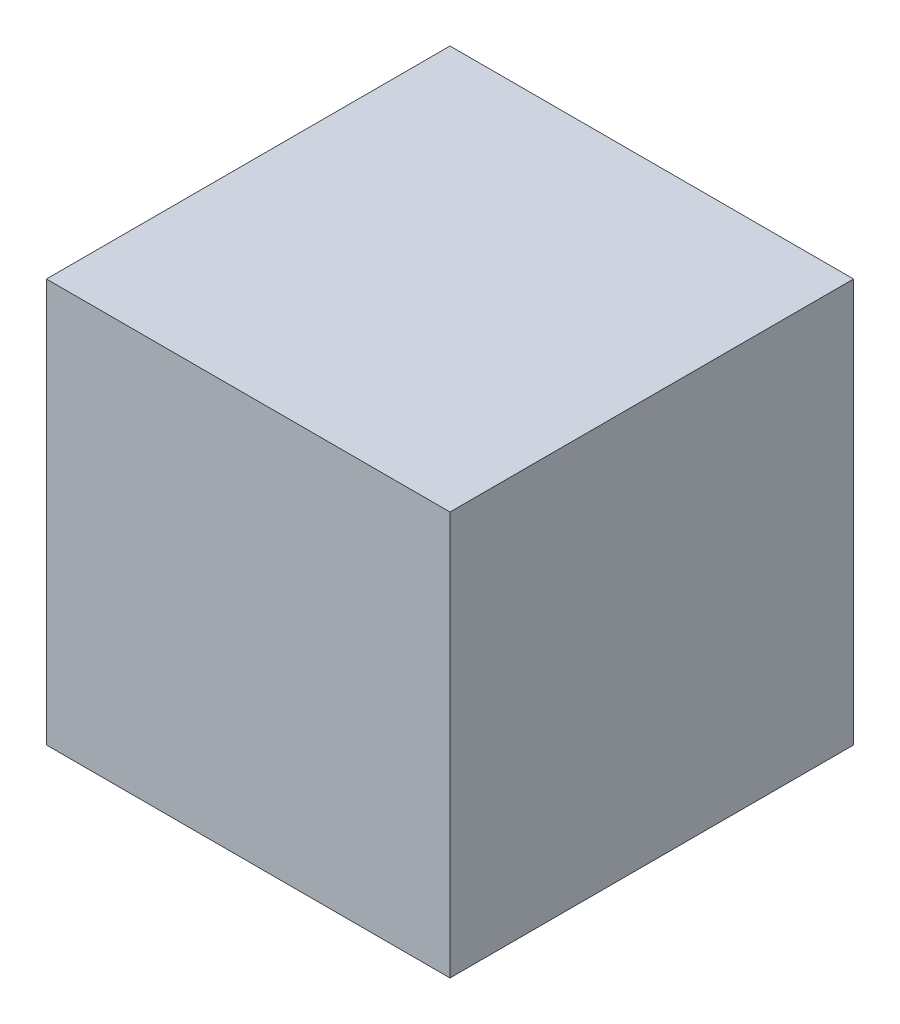
ISO-10303-21;
HEADER;
FILE_DESCRIPTION(('STEP AP214'),'2;1');
FILE_NAME('part.step','',(''),(''),'','','');
FILE_SCHEMA(('AUTOMOTIVE_DESIGN { 1 0 10303 214 1 1 1 1 }'));
ENDSEC;
DATA;
#1=APPLICATION_CONTEXT('core data for automotive mechanical design processes');
#2=APPLICATION_PROTOCOL_DEFINITION('international standard','automotive_design',2000,#1);
#3=PRODUCT_CONTEXT('',#1,'mechanical');
#4=PRODUCT('Part','Part','',(#3));
#5=PRODUCT_RELATED_PRODUCT_CATEGORY('part','',(#4));
#6=PRODUCT_DEFINITION_FORMATION('','',#4);
#7=PRODUCT_DEFINITION_CONTEXT('part definition',#1,'design');
#8=PRODUCT_DEFINITION('design','',#6,#7);
#9=PRODUCT_DEFINITION_SHAPE('','',#8);
#10=(LENGTH_UNIT() NAMED_UNIT(*) SI_UNIT(.MILLI.,.METRE.));
#11=(NAMED_UNIT(*) PLANE_ANGLE_UNIT() SI_UNIT($,.RADIAN.));
#12=(NAMED_UNIT(*) SI_UNIT($,.STERADIAN.) SOLID_ANGLE_UNIT());
#13=UNCERTAINTY_MEASURE_WITH_UNIT(LENGTH_MEASURE(1.E-05),#10,'distance_accuracy_value','');
#14=(GEOMETRIC_REPRESENTATION_CONTEXT(3) GLOBAL_UNCERTAINTY_ASSIGNED_CONTEXT((#13)) GLOBAL_UNIT_ASSIGNED_CONTEXT((#10,
#11,#12)) REPRESENTATION_CONTEXT('',''));
#15=CARTESIAN_POINT('',(0.,0.,0.));
#16=DIRECTION('',(0.,0.,1.));
#17=DIRECTION('',(1.,0.,0.));
#18=AXIS2_PLACEMENT_3D('',#15,#16,#17);
#19=CARTESIAN_POINT('',(-30.,30.,60.));
#20=DIRECTION('',(1.,0.,0.));
#21=DIRECTION('',(0.,1.,0.));
#22=AXIS2_PLACEMENT_3D('',#19,#20,#21);
#23=PLANE('',#22);
#24=DIRECTION('',(0.,-1.,0.));
#25=VECTOR('',#24,1.);
#26=CARTESIAN_POINT('',(-30.,30.,0.));
#27=LINE('',#26,#25);
#28=CARTESIAN_POINT('',(-30.,30.,0.));
#29=VERTEX_POINT('',#28);
#30=CARTESIAN_POINT('',(-30.,-30.,0.));
#31=VERTEX_POINT('',#30);
#32=EDGE_CURVE('E95',#29,#31,#27,.T.);
#33=ORIENTED_EDGE('',*,*,#32,.T.);
#34=DIRECTION('',(0.,0.,-1.));
#35=VECTOR('',#34,1.);
#36=CARTESIAN_POINT('',(-30.,-30.,60.));
#37=LINE('',#36,#35);
#38=CARTESIAN_POINT('',(-30.,-30.,60.));
#39=VERTEX_POINT('',#38);
#40=EDGE_CURVE('E11',#39,#31,#37,.T.);
#41=ORIENTED_EDGE('',*,*,#40,.F.);
#42=DIRECTION('',(0.,-1.,0.));
#43=VECTOR('',#42,1.);
#44=CARTESIAN_POINT('',(-30.,30.,60.));
#45=LINE('',#44,#43);
#46=CARTESIAN_POINT('',(-30.,30.,60.));
#47=VERTEX_POINT('',#46);
#48=EDGE_CURVE('E83',#47,#39,#45,.T.);
#49=ORIENTED_EDGE('',*,*,#48,.F.);
#50=DIRECTION('',(0.,0.,-1.));
#51=VECTOR('',#50,1.);
#52=CARTESIAN_POINT('',(-30.,30.,60.));
#53=LINE('',#52,#51);
#54=EDGE_CURVE('E91',#47,#29,#53,.T.);
#55=ORIENTED_EDGE('',*,*,#54,.T.);
#56=EDGE_LOOP('',(#33,#41,#49,#55));
#57=FACE_BOUND('',#56,.T.);
#58=ADVANCED_FACE('F32',(#57),#23,.F.);
#59=CARTESIAN_POINT('',(-30.,-30.,60.));
#60=DIRECTION('',(0.,1.,0.));
#61=DIRECTION('',(0.,0.,1.));
#62=AXIS2_PLACEMENT_3D('',#59,#60,#61);
#63=PLANE('',#62);
#64=DIRECTION('',(1.,0.,0.));
#65=VECTOR('',#64,1.);
#66=CARTESIAN_POINT('',(-30.,-30.,0.));
#67=LINE('',#66,#65);
#68=CARTESIAN_POINT('',(30.,-30.,0.));
#69=VERTEX_POINT('',#68);
#70=EDGE_CURVE('E87',#31,#69,#67,.T.);
#71=ORIENTED_EDGE('',*,*,#70,.T.);
#72=DIRECTION('',(0.,0.,-1.));
#73=VECTOR('',#72,1.);
#74=CARTESIAN_POINT('',(30.,-30.,60.));
#75=LINE('',#74,#73);
#76=CARTESIAN_POINT('',(30.,-30.,60.));
#77=VERTEX_POINT('',#76);
#78=EDGE_CURVE('E40',#77,#69,#75,.T.);
#79=ORIENTED_EDGE('',*,*,#78,.F.);
#80=DIRECTION('',(1.,0.,0.));
#81=VECTOR('',#80,1.);
#82=CARTESIAN_POINT('',(-30.,-30.,60.));
#83=LINE('',#82,#81);
#84=EDGE_CURVE('E78',#39,#77,#83,.T.);
#85=ORIENTED_EDGE('',*,*,#84,.F.);
#86=ORIENTED_EDGE('',*,*,#40,.T.);
#87=EDGE_LOOP('',(#71,#79,#85,#86));
#88=FACE_BOUND('',#87,.T.);
#89=ADVANCED_FACE('F86',(#88),#63,.F.);
#90=CARTESIAN_POINT('',(30.,30.,60.));
#91=DIRECTION('',(-1.,0.,0.));
#92=DIRECTION('',(0.,-1.,0.));
#93=AXIS2_PLACEMENT_3D('',#90,#91,#92);
#94=PLANE('',#93);
#95=DIRECTION('',(0.,1.,0.));
#96=VECTOR('',#95,1.);
#97=CARTESIAN_POINT('',(30.,30.,0.));
#98=LINE('',#97,#96);
#99=CARTESIAN_POINT('',(30.,30.,0.));
#100=VERTEX_POINT('',#99);
#101=EDGE_CURVE('E65',#69,#100,#98,.T.);
#102=ORIENTED_EDGE('',*,*,#101,.T.);
#103=DIRECTION('',(0.,0.,-1.));
#104=VECTOR('',#103,1.);
#105=CARTESIAN_POINT('',(30.,30.,60.));
#106=LINE('',#105,#104);
#107=CARTESIAN_POINT('',(30.,30.,60.));
#108=VERTEX_POINT('',#107);
#109=EDGE_CURVE('E88',#108,#100,#106,.T.);
#110=ORIENTED_EDGE('',*,*,#109,.F.);
#111=DIRECTION('',(0.,1.,0.));
#112=VECTOR('',#111,1.);
#113=CARTESIAN_POINT('',(30.,30.,60.));
#114=LINE('',#113,#112);
#115=EDGE_CURVE('E81',#77,#108,#114,.T.);
#116=ORIENTED_EDGE('',*,*,#115,.F.);
#117=ORIENTED_EDGE('',*,*,#78,.T.);
#118=EDGE_LOOP('',(#102,#110,#116,#117));
#119=FACE_BOUND('',#118,.T.);
#120=ADVANCED_FACE('F89',(#119),#94,.F.);
#121=CARTESIAN_POINT('',(-30.,30.,60.));
#122=DIRECTION('',(0.,-1.,0.));
#123=DIRECTION('',(0.,0.,-1.));
#124=AXIS2_PLACEMENT_3D('',#121,#122,#123);
#125=PLANE('',#124);
#126=DIRECTION('',(-1.,0.,0.));
#127=VECTOR('',#126,1.);
#128=CARTESIAN_POINT('',(-30.,30.,0.));
#129=LINE('',#128,#127);
#130=EDGE_CURVE('E71',#100,#29,#129,.T.);
#131=ORIENTED_EDGE('',*,*,#130,.T.);
#132=ORIENTED_EDGE('',*,*,#54,.F.);
#133=DIRECTION('',(-1.,0.,0.));
#134=VECTOR('',#133,1.);
#135=CARTESIAN_POINT('',(-30.,30.,60.));
#136=LINE('',#135,#134);
#137=EDGE_CURVE('E48',#108,#47,#136,.T.);
#138=ORIENTED_EDGE('',*,*,#137,.F.);
#139=ORIENTED_EDGE('',*,*,#109,.T.);
#140=EDGE_LOOP('',(#131,#132,#138,#139));
#141=FACE_BOUND('',#140,.T.);
#142=ADVANCED_FACE('F102',(#141),#125,.F.);
#143=CARTESIAN_POINT('',(0.,0.,60.));
#144=DIRECTION('',(0.,0.,1.));
#145=DIRECTION('',(1.,0.,0.));
#146=AXIS2_PLACEMENT_3D('',#143,#144,#145);
#147=PLANE('',#146);
#148=ORIENTED_EDGE('',*,*,#48,.T.);
#149=ORIENTED_EDGE('',*,*,#84,.T.);
#150=ORIENTED_EDGE('',*,*,#115,.T.);
#151=ORIENTED_EDGE('',*,*,#137,.T.);
#152=EDGE_LOOP('',(#148,#149,#150,#151));
#153=FACE_BOUND('',#152,.T.);
#154=ADVANCED_FACE('F79',(#153),#147,.T.);
#155=CARTESIAN_POINT('',(0.,0.,0.));
#156=DIRECTION('',(0.,0.,1.));
#157=DIRECTION('',(1.,0.,0.));
#158=AXIS2_PLACEMENT_3D('',#155,#156,#157);
#159=PLANE('',#158);
#160=ORIENTED_EDGE('',*,*,#32,.F.);
#161=ORIENTED_EDGE('',*,*,#130,.F.);
#162=ORIENTED_EDGE('',*,*,#101,.F.);
#163=ORIENTED_EDGE('',*,*,#70,.F.);
#164=EDGE_LOOP('',(#160,#161,#162,#163));
#165=FACE_BOUND('',#164,.T.);
#166=ADVANCED_FACE('F105',(#165),#159,.F.);
#167=CLOSED_SHELL('',(#58,#89,#120,#142,#154,#166));
#168=MANIFOLD_SOLID_BREP('B2',#167);
#169=ADVANCED_BREP_SHAPE_REPRESENTATION('',(#18,#168),#14);
#170=SHAPE_DEFINITION_REPRESENTATION(#9,#169);
ENDSEC;
END-ISO-10303-21;
